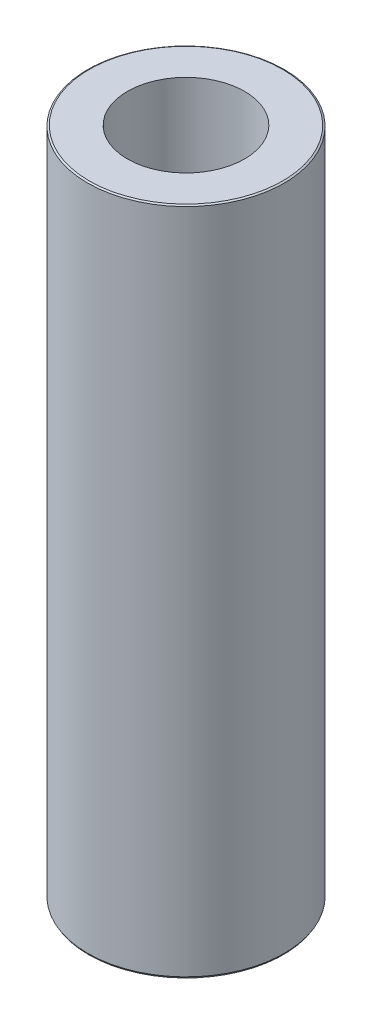
ISO-10303-21;
HEADER;
FILE_DESCRIPTION(('STEP AP214'),'2;1');
FILE_NAME('part.step','',(''),(''),'','','');
FILE_SCHEMA(('AUTOMOTIVE_DESIGN { 1 0 10303 214 1 1 1 1 }'));
ENDSEC;
DATA;
#1=APPLICATION_CONTEXT('core data for automotive mechanical design processes');
#2=APPLICATION_PROTOCOL_DEFINITION('international standard','automotive_design',2000,#1);
#3=PRODUCT_CONTEXT('',#1,'mechanical');
#4=PRODUCT('Part','Part','',(#3));
#5=PRODUCT_RELATED_PRODUCT_CATEGORY('part','',(#4));
#6=PRODUCT_DEFINITION_FORMATION('','',#4);
#7=PRODUCT_DEFINITION_CONTEXT('part definition',#1,'design');
#8=PRODUCT_DEFINITION('design','',#6,#7);
#9=PRODUCT_DEFINITION_SHAPE('','',#8);
#10=(LENGTH_UNIT() NAMED_UNIT(*) SI_UNIT(.MILLI.,.METRE.));
#11=(NAMED_UNIT(*) PLANE_ANGLE_UNIT() SI_UNIT($,.RADIAN.));
#12=(NAMED_UNIT(*) SI_UNIT($,.STERADIAN.) SOLID_ANGLE_UNIT());
#13=UNCERTAINTY_MEASURE_WITH_UNIT(LENGTH_MEASURE(1.E-05),#10,'distance_accuracy_value','');
#14=(GEOMETRIC_REPRESENTATION_CONTEXT(3) GLOBAL_UNCERTAINTY_ASSIGNED_CONTEXT((#13)) GLOBAL_UNIT_ASSIGNED_CONTEXT((#10,
#11,#12)) REPRESENTATION_CONTEXT('',''));
#15=CARTESIAN_POINT('',(0.,0.,0.));
#16=DIRECTION('',(0.,0.,1.));
#17=DIRECTION('',(1.,0.,0.));
#18=AXIS2_PLACEMENT_3D('',#15,#16,#17);
#19=CARTESIAN_POINT('',(0.,289.378602009243,0.));
#20=DIRECTION('',(0.,-1.,0.));
#21=DIRECTION('',(0.,0.,-1.));
#22=AXIS2_PLACEMENT_3D('',#19,#20,#21);
#23=CYLINDRICAL_SURFACE('',#22,42.5);
#24=CARTESIAN_POINT('',(0.,288.958412310282,0.));
#25=DIRECTION('',(0.,1.,0.));
#26=DIRECTION('',(0.,0.,1.));
#27=AXIS2_PLACEMENT_3D('',#24,#25,#26);
#28=CIRCLE('',#27,42.5);
#29=CARTESIAN_POINT('',(0.,288.958412310282,42.5));
#30=VERTEX_POINT('',#29);
#31=EDGE_CURVE('E50',#30,#30,#28,.F.);
#32=ORIENTED_EDGE('',*,*,#31,.T.);
#33=EDGE_LOOP('',(#32));
#34=FACE_BOUND('',#33,.T.);
#35=CARTESIAN_POINT('',(0.,0.727789907416676,0.));
#36=DIRECTION('',(0.,1.,0.));
#37=DIRECTION('',(0.,0.,1.));
#38=AXIS2_PLACEMENT_3D('',#35,#36,#37);
#39=CIRCLE('',#38,42.5);
#40=CARTESIAN_POINT('',(0.,0.727789907416676,42.5));
#41=VERTEX_POINT('',#40);
#42=EDGE_CURVE('E51',#41,#41,#39,.T.);
#43=ORIENTED_EDGE('',*,*,#42,.T.);
#44=EDGE_LOOP('',(#43));
#45=FACE_BOUND('',#44,.T.);
#46=ADVANCED_FACE('F39',(#34,#45),#23,.T.);
#47=CARTESIAN_POINT('',(0.,289.378602009243,0.));
#48=DIRECTION('',(0.,1.,0.));
#49=DIRECTION('',(0.,0.,1.));
#50=AXIS2_PLACEMENT_3D('',#47,#48,#49);
#51=PLANE('',#50);
#52=CARTESIAN_POINT('',(0.,289.378602009243,0.));
#53=DIRECTION('',(0.,1.,0.));
#54=DIRECTION('',(0.,0.,1.));
#55=AXIS2_PLACEMENT_3D('',#52,#53,#54);
#56=CIRCLE('',#55,41.7722100925833);
#57=CARTESIAN_POINT('',(0.,289.378602009243,41.7722100925833));
#58=VERTEX_POINT('',#57);
#59=EDGE_CURVE('E54',#58,#58,#56,.T.);
#60=ORIENTED_EDGE('',*,*,#59,.T.);
#61=EDGE_LOOP('',(#60));
#62=FACE_BOUND('',#61,.T.);
#63=CARTESIAN_POINT('',(0.,289.378602009243,0.));
#64=DIRECTION('',(0.,1.,0.));
#65=DIRECTION('',(0.,0.,1.));
#66=AXIS2_PLACEMENT_3D('',#63,#64,#65);
#67=CIRCLE('',#66,25.3236278169601);
#68=CARTESIAN_POINT('',(0.,289.378602009243,25.3236278169601));
#69=VERTEX_POINT('',#68);
#70=EDGE_CURVE('E58',#69,#69,#67,.T.);
#71=ORIENTED_EDGE('',*,*,#70,.F.);
#72=EDGE_LOOP('',(#71));
#73=FACE_BOUND('',#72,.T.);
#74=ADVANCED_FACE('F69',(#62,#73),#51,.T.);
#75=CARTESIAN_POINT('',(0.,0.,0.));
#76=DIRECTION('',(0.,1.,0.));
#77=DIRECTION('',(0.,0.,1.));
#78=AXIS2_PLACEMENT_3D('',#75,#76,#77);
#79=PLANE('',#78);
#80=CARTESIAN_POINT('',(0.,0.,0.));
#81=DIRECTION('',(0.,1.,0.));
#82=DIRECTION('',(0.,0.,1.));
#83=AXIS2_PLACEMENT_3D('',#80,#81,#82);
#84=CIRCLE('',#83,42.0798103010395);
#85=CARTESIAN_POINT('',(0.,0.,42.0798103010395));
#86=VERTEX_POINT('',#85);
#87=EDGE_CURVE('E10',#86,#86,#84,.F.);
#88=ORIENTED_EDGE('',*,*,#87,.T.);
#89=EDGE_LOOP('',(#88));
#90=FACE_BOUND('',#89,.T.);
#91=CARTESIAN_POINT('',(0.,0.,0.));
#92=DIRECTION('',(0.,1.,0.));
#93=DIRECTION('',(0.,0.,1.));
#94=AXIS2_PLACEMENT_3D('',#91,#92,#93);
#95=CIRCLE('',#94,25.3236278169601);
#96=CARTESIAN_POINT('',(0.,0.,25.3236278169601));
#97=VERTEX_POINT('',#96);
#98=EDGE_CURVE('E63',#97,#97,#95,.T.);
#99=ORIENTED_EDGE('',*,*,#98,.T.);
#100=EDGE_LOOP('',(#99));
#101=FACE_BOUND('',#100,.T.);
#102=ADVANCED_FACE('F75',(#90,#101),#79,.F.);
#103=CARTESIAN_POINT('',(0.,289.378602009243,0.));
#104=DIRECTION('',(0.,-1.,0.));
#105=DIRECTION('',(0.,0.,-1.));
#106=AXIS2_PLACEMENT_3D('',#103,#104,#105);
#107=CYLINDRICAL_SURFACE('',#106,25.3236278169601);
#108=ORIENTED_EDGE('',*,*,#70,.T.);
#109=EDGE_LOOP('',(#108));
#110=FACE_BOUND('',#109,.T.);
#111=ORIENTED_EDGE('',*,*,#98,.F.);
#112=EDGE_LOOP('',(#111));
#113=FACE_BOUND('',#112,.T.);
#114=ADVANCED_FACE('F70',(#110,#113),#107,.F.);
#115=CARTESIAN_POINT('',(0.,289.378602009243,0.));
#116=DIRECTION('',(0.,-1.,0.));
#117=DIRECTION('',(0.,0.,-1.));
#118=AXIS2_PLACEMENT_3D('',#115,#116,#117);
#119=CONICAL_SURFACE('',#118,41.7722100925833,1.04719755119661);
#120=ORIENTED_EDGE('',*,*,#31,.F.);
#121=EDGE_LOOP('',(#120));
#122=FACE_BOUND('',#121,.T.);
#123=ORIENTED_EDGE('',*,*,#59,.F.);
#124=EDGE_LOOP('',(#123));
#125=FACE_BOUND('',#124,.T.);
#126=ADVANCED_FACE('F81',(#122,#125),#119,.T.);
#127=CARTESIAN_POINT('',(0.,0.727789907416676,0.));
#128=DIRECTION('',(0.,1.,0.));
#129=DIRECTION('',(0.,0.,1.));
#130=AXIS2_PLACEMENT_3D('',#127,#128,#129);
#131=CONICAL_SURFACE('',#130,42.5,0.523598775598276);
#132=ORIENTED_EDGE('',*,*,#87,.F.);
#133=EDGE_LOOP('',(#132));
#134=FACE_BOUND('',#133,.T.);
#135=ORIENTED_EDGE('',*,*,#42,.F.);
#136=EDGE_LOOP('',(#135));
#137=FACE_BOUND('',#136,.T.);
#138=ADVANCED_FACE('F45',(#134,#137),#131,.T.);
#139=CLOSED_SHELL('',(#46,#74,#102,#114,#126,#138));
#140=MANIFOLD_SOLID_BREP('B2',#139);
#141=ADVANCED_BREP_SHAPE_REPRESENTATION('',(#18,#140),#14);
#142=SHAPE_DEFINITION_REPRESENTATION(#9,#141);
ENDSEC;
END-ISO-10303-21;
